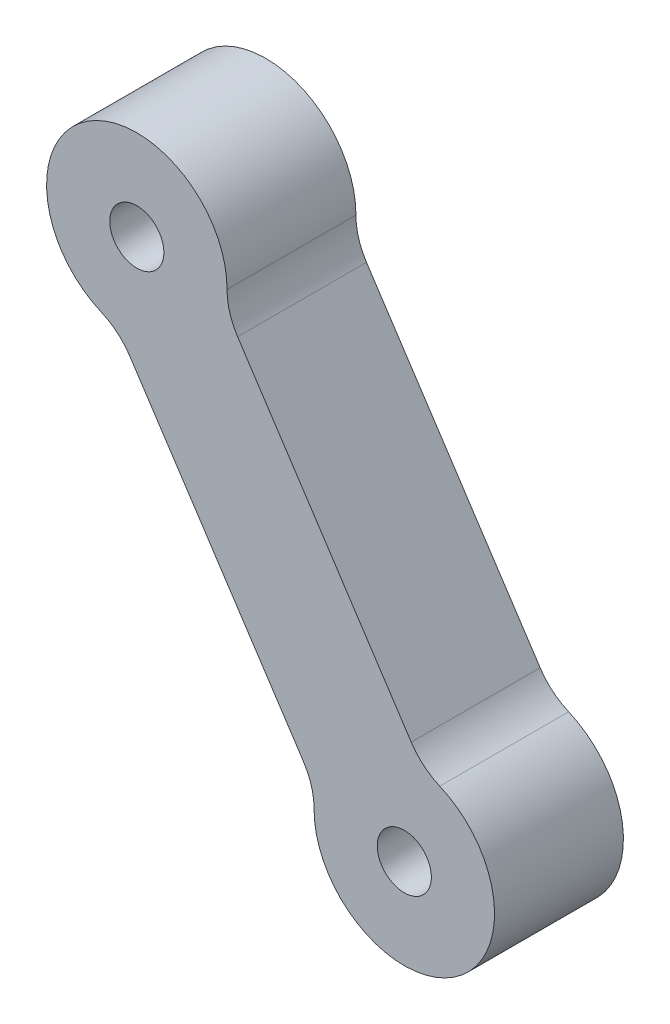
ISO-10303-21;
HEADER;
FILE_DESCRIPTION(('STEP AP214'),'2;1');
FILE_NAME('part.step','',(''),(''),'','','');
FILE_SCHEMA(('AUTOMOTIVE_DESIGN { 1 0 10303 214 1 1 1 1 }'));
ENDSEC;
DATA;
#1=APPLICATION_CONTEXT('core data for automotive mechanical design processes');
#2=APPLICATION_PROTOCOL_DEFINITION('international standard','automotive_design',2000,#1);
#3=PRODUCT_CONTEXT('',#1,'mechanical');
#4=PRODUCT('Part','Part','',(#3));
#5=PRODUCT_RELATED_PRODUCT_CATEGORY('part','',(#4));
#6=PRODUCT_DEFINITION_FORMATION('','',#4);
#7=PRODUCT_DEFINITION_CONTEXT('part definition',#1,'design');
#8=PRODUCT_DEFINITION('design','',#6,#7);
#9=PRODUCT_DEFINITION_SHAPE('','',#8);
#10=(LENGTH_UNIT() NAMED_UNIT(*) SI_UNIT(.MILLI.,.METRE.));
#11=(NAMED_UNIT(*) PLANE_ANGLE_UNIT() SI_UNIT($,.RADIAN.));
#12=(NAMED_UNIT(*) SI_UNIT($,.STERADIAN.) SOLID_ANGLE_UNIT());
#13=UNCERTAINTY_MEASURE_WITH_UNIT(LENGTH_MEASURE(1.E-05),#10,'distance_accuracy_value','');
#14=(GEOMETRIC_REPRESENTATION_CONTEXT(3) GLOBAL_UNCERTAINTY_ASSIGNED_CONTEXT((#13)) GLOBAL_UNIT_ASSIGNED_CONTEXT((#10,
#11,#12)) REPRESENTATION_CONTEXT('',''));
#15=CARTESIAN_POINT('',(0.,0.,0.));
#16=DIRECTION('',(0.,0.,1.));
#17=DIRECTION('',(1.,0.,0.));
#18=AXIS2_PLACEMENT_3D('',#15,#16,#17);
#19=CARTESIAN_POINT('',(-19.7540999404094,64.5773732818627,10.));
#20=DIRECTION('',(0.,0.,1.));
#21=DIRECTION('',(1.,0.,0.));
#22=AXIS2_PLACEMENT_3D('',#19,#20,#21);
#23=PLANE('',#22);
#24=CARTESIAN_POINT('',(-31.7539813915032,64.6309146550479,10.));
#25=DIRECTION('',(0.,0.,1.));
#26=DIRECTION('',(1.,0.,0.));
#27=AXIS2_PLACEMENT_3D('',#24,#25,#26);
#28=CIRCLE('',#27,2.1);
#29=CARTESIAN_POINT('',(-29.6539813915032,64.6309146550479,10.));
#30=VERTEX_POINT('',#29);
#31=EDGE_CURVE('E138',#30,#30,#28,.T.);
#32=ORIENTED_EDGE('',*,*,#31,.F.);
#33=EDGE_LOOP('',(#32));
#34=FACE_BOUND('',#33,.T.);
#35=CARTESIAN_POINT('',(-19.7540999404094,64.5773732818627,10.));
#36=DIRECTION('',(0.,0.,-1.));
#37=DIRECTION('',(1.,0.,0.));
#38=AXIS2_PLACEMENT_3D('',#35,#36,#37);
#39=CIRCLE('',#38,5.00000089662269);
#40=CARTESIAN_POINT('',(-23.9330576547524,61.8321371557778,10.));
#41=VERTEX_POINT('',#40);
#42=CARTESIAN_POINT('',(-24.7540510680565,64.5996821896899,10.));
#43=VERTEX_POINT('',#42);
#44=EDGE_CURVE('E149',#41,#43,#39,.T.);
#45=ORIENTED_EDGE('',*,*,#44,.T.);
#46=CARTESIAN_POINT('',(-31.7539813915032,64.6309146550479,10.));
#47=DIRECTION('',(0.,0.,1.));
#48=DIRECTION('',(1.,0.,0.));
#49=AXIS2_PLACEMENT_3D('',#46,#47,#48);
#50=CIRCLE('',#49,7.00000000000004);
#51=CARTESIAN_POINT('',(-34.5049506536515,58.1941322198,10.));
#52=VERTEX_POINT('',#51);
#53=EDGE_CURVE('E97',#43,#52,#50,.T.);
#54=ORIENTED_EDGE('',*,*,#53,.T.);
#55=CARTESIAN_POINT('',(-36.4699286980433,53.5964304803371,10.));
#56=DIRECTION('',(0.,0.,-1.));
#57=DIRECTION('',(-1.,0.,0.));
#58=AXIS2_PLACEMENT_3D('',#55,#56,#57);
#59=CIRCLE('',#58,5.00000000000024);
#60=CARTESIAN_POINT('',(-32.2909717330897,56.341666114134,10.));
#61=VERTEX_POINT('',#60);
#62=EDGE_CURVE('E164',#52,#61,#59,.T.);
#63=ORIENTED_EDGE('',*,*,#62,.T.);
#64=DIRECTION('',(0.549047126759343,-0.835791392990685,0.));
#65=VECTOR('',#64,1.);
#66=CARTESIAN_POINT('',(-32.2909717330897,56.341666114134,10.));
#67=LINE('',#66,#65);
#68=CARTESIAN_POINT('',(-18.8209235883203,35.8367772733204,10.));
#69=VERTEX_POINT('',#68);
#70=EDGE_CURVE('E177',#61,#69,#67,.T.);
#71=ORIENTED_EDGE('',*,*,#70,.T.);
#72=CARTESIAN_POINT('',(-22.9998805532737,33.0915416395237,10.));
#73=DIRECTION('',(0.,0.,-1.));
#74=DIRECTION('',(-1.,0.,0.));
#75=AXIS2_PLACEMENT_3D('',#72,#73,#74);
#76=CIRCLE('',#75,4.99999999999998);
#77=CARTESIAN_POINT('',(-17.999930322743,33.0692326230555,10.));
#78=VERTEX_POINT('',#77);
#79=EDGE_CURVE('E116',#69,#78,#76,.T.);
#80=ORIENTED_EDGE('',*,*,#79,.T.);
#81=CARTESIAN_POINT('',(-11.,33.038,10.));
#82=DIRECTION('',(0.,0.,1.));
#83=DIRECTION('',(-1.,0.,0.));
#84=AXIS2_PLACEMENT_3D('',#81,#82,#83);
#85=CIRCLE('',#84,7.);
#86=CARTESIAN_POINT('',(-8.24903053277566,39.4747823476019,10.));
#87=VERTEX_POINT('',#86);
#88=EDGE_CURVE('E110',#78,#87,#85,.T.);
#89=ORIENTED_EDGE('',*,*,#88,.T.);
#90=CARTESIAN_POINT('',(-6.28405269346,44.0724841747107,10.));
#91=DIRECTION('',(0.,0.,-1.));
#92=DIRECTION('',(1.,0.,0.));
#93=AXIS2_PLACEMENT_3D('',#90,#91,#92);
#94=CIRCLE('',#93,5.00000000000009);
#95=CARTESIAN_POINT('',(-10.4630096584135,41.3272485409139,10.));
#96=VERTEX_POINT('',#95);
#97=EDGE_CURVE('E114',#87,#96,#94,.T.);
#98=ORIENTED_EDGE('',*,*,#97,.T.);
#99=DIRECTION('',(-0.549047126759344,0.835791392990684,0.));
#100=VECTOR('',#99,1.);
#101=CARTESIAN_POINT('',(-23.9330576547524,61.8321371557778,10.));
#102=LINE('',#101,#100);
#103=EDGE_CURVE('E54',#96,#41,#102,.T.);
#104=ORIENTED_EDGE('',*,*,#103,.T.);
#105=EDGE_LOOP('',(#45,#54,#63,#71,#80,#89,#98,#104));
#106=FACE_BOUND('',#105,.T.);
#107=CARTESIAN_POINT('',(-11.,33.038,10.));
#108=DIRECTION('',(0.,0.,1.));
#109=DIRECTION('',(1.,0.,0.));
#110=AXIS2_PLACEMENT_3D('',#107,#108,#109);
#111=CIRCLE('',#110,2.1);
#112=CARTESIAN_POINT('',(-8.9,33.038,10.));
#113=VERTEX_POINT('',#112);
#114=EDGE_CURVE('E186',#113,#113,#111,.T.);
#115=ORIENTED_EDGE('',*,*,#114,.F.);
#116=EDGE_LOOP('',(#115));
#117=FACE_BOUND('',#116,.T.);
#118=ADVANCED_FACE('F37',(#34,#106,#117),#23,.T.);
#119=CARTESIAN_POINT('',(-19.7540999404094,64.5773732818627,0.));
#120=DIRECTION('',(0.,0.,1.));
#121=DIRECTION('',(1.,0.,0.));
#122=AXIS2_PLACEMENT_3D('',#119,#120,#121);
#123=PLANE('',#122);
#124=CARTESIAN_POINT('',(-19.7540999404094,64.5773732818627,0.));
#125=DIRECTION('',(0.,0.,-1.));
#126=DIRECTION('',(1.,0.,0.));
#127=AXIS2_PLACEMENT_3D('',#124,#125,#126);
#128=CIRCLE('',#127,5.00000089662269);
#129=CARTESIAN_POINT('',(-23.9330576547524,61.8321371557778,0.));
#130=VERTEX_POINT('',#129);
#131=CARTESIAN_POINT('',(-24.7540510680565,64.5996821896899,0.));
#132=VERTEX_POINT('',#131);
#133=EDGE_CURVE('E134',#130,#132,#128,.T.);
#134=ORIENTED_EDGE('',*,*,#133,.F.);
#135=DIRECTION('',(-0.549047126759344,0.835791392990684,0.));
#136=VECTOR('',#135,1.);
#137=CARTESIAN_POINT('',(-23.9330576547524,61.8321371557778,0.));
#138=LINE('',#137,#136);
#139=CARTESIAN_POINT('',(-10.4630096584135,41.3272485409139,0.));
#140=VERTEX_POINT('',#139);
#141=EDGE_CURVE('E89',#140,#130,#138,.T.);
#142=ORIENTED_EDGE('',*,*,#141,.F.);
#143=CARTESIAN_POINT('',(-6.28405269346,44.0724841747107,0.));
#144=DIRECTION('',(0.,0.,-1.));
#145=DIRECTION('',(1.,0.,0.));
#146=AXIS2_PLACEMENT_3D('',#143,#144,#145);
#147=CIRCLE('',#146,5.00000000000009);
#148=CARTESIAN_POINT('',(-8.24903053277566,39.4747823476019,0.));
#149=VERTEX_POINT('',#148);
#150=EDGE_CURVE('E83',#149,#140,#147,.T.);
#151=ORIENTED_EDGE('',*,*,#150,.F.);
#152=CARTESIAN_POINT('',(-11.,33.038,0.));
#153=DIRECTION('',(0.,0.,1.));
#154=DIRECTION('',(-1.,0.,0.));
#155=AXIS2_PLACEMENT_3D('',#152,#153,#154);
#156=CIRCLE('',#155,7.);
#157=CARTESIAN_POINT('',(-17.999930322743,33.0692326230555,0.));
#158=VERTEX_POINT('',#157);
#159=EDGE_CURVE('E124',#158,#149,#156,.T.);
#160=ORIENTED_EDGE('',*,*,#159,.F.);
#161=CARTESIAN_POINT('',(-22.9998805532737,33.0915416395237,0.));
#162=DIRECTION('',(0.,0.,-1.));
#163=DIRECTION('',(-1.,0.,0.));
#164=AXIS2_PLACEMENT_3D('',#161,#162,#163);
#165=CIRCLE('',#164,4.99999999999998);
#166=CARTESIAN_POINT('',(-18.8209235883203,35.8367772733204,0.));
#167=VERTEX_POINT('',#166);
#168=EDGE_CURVE('E144',#167,#158,#165,.T.);
#169=ORIENTED_EDGE('',*,*,#168,.F.);
#170=DIRECTION('',(0.549047126759343,-0.835791392990685,0.));
#171=VECTOR('',#170,1.);
#172=CARTESIAN_POINT('',(-32.2909717330897,56.341666114134,0.));
#173=LINE('',#172,#171);
#174=CARTESIAN_POINT('',(-32.2909717330897,56.341666114134,0.));
#175=VERTEX_POINT('',#174);
#176=EDGE_CURVE('E142',#175,#167,#173,.T.);
#177=ORIENTED_EDGE('',*,*,#176,.F.);
#178=CARTESIAN_POINT('',(-36.4699286980433,53.5964304803371,0.));
#179=DIRECTION('',(0.,0.,-1.));
#180=DIRECTION('',(-1.,0.,0.));
#181=AXIS2_PLACEMENT_3D('',#178,#179,#180);
#182=CIRCLE('',#181,5.00000000000024);
#183=CARTESIAN_POINT('',(-34.5049506536515,58.1941322198,0.));
#184=VERTEX_POINT('',#183);
#185=EDGE_CURVE('E140',#184,#175,#182,.T.);
#186=ORIENTED_EDGE('',*,*,#185,.F.);
#187=CARTESIAN_POINT('',(-31.7539813915032,64.6309146550479,0.));
#188=DIRECTION('',(0.,0.,1.));
#189=DIRECTION('',(1.,0.,0.));
#190=AXIS2_PLACEMENT_3D('',#187,#188,#189);
#191=CIRCLE('',#190,7.00000000000004);
#192=EDGE_CURVE('E137',#132,#184,#191,.T.);
#193=ORIENTED_EDGE('',*,*,#192,.F.);
#194=EDGE_LOOP('',(#134,#142,#151,#160,#169,#177,#186,#193));
#195=FACE_BOUND('',#194,.T.);
#196=CARTESIAN_POINT('',(-31.7539813915032,64.6309146550479,0.));
#197=DIRECTION('',(0.,0.,1.));
#198=DIRECTION('',(1.,0.,0.));
#199=AXIS2_PLACEMENT_3D('',#196,#197,#198);
#200=CIRCLE('',#199,2.1);
#201=CARTESIAN_POINT('',(-29.6539813915032,64.6309146550479,0.));
#202=VERTEX_POINT('',#201);
#203=EDGE_CURVE('E183',#202,#202,#200,.T.);
#204=ORIENTED_EDGE('',*,*,#203,.T.);
#205=EDGE_LOOP('',(#204));
#206=FACE_BOUND('',#205,.T.);
#207=CARTESIAN_POINT('',(-11.,33.038,0.));
#208=DIRECTION('',(0.,0.,1.));
#209=DIRECTION('',(1.,0.,0.));
#210=AXIS2_PLACEMENT_3D('',#207,#208,#209);
#211=CIRCLE('',#210,2.1);
#212=CARTESIAN_POINT('',(-8.9,33.038,0.));
#213=VERTEX_POINT('',#212);
#214=EDGE_CURVE('E189',#213,#213,#211,.T.);
#215=ORIENTED_EDGE('',*,*,#214,.T.);
#216=EDGE_LOOP('',(#215));
#217=FACE_BOUND('',#216,.T.);
#218=ADVANCED_FACE('F168',(#195,#206,#217),#123,.F.);
#219=CARTESIAN_POINT('',(-19.7540999404094,64.5773732818627,10.));
#220=DIRECTION('',(0.,0.,-1.));
#221=DIRECTION('',(-1.,0.,0.));
#222=AXIS2_PLACEMENT_3D('',#219,#220,#221);
#223=CYLINDRICAL_SURFACE('',#222,5.00000089662269);
#224=ORIENTED_EDGE('',*,*,#133,.T.);
#225=DIRECTION('',(0.,0.,-1.));
#226=VECTOR('',#225,1.);
#227=CARTESIAN_POINT('',(-24.7540510680565,64.5996821896899,10.));
#228=LINE('',#227,#226);
#229=EDGE_CURVE('E11',#43,#132,#228,.T.);
#230=ORIENTED_EDGE('',*,*,#229,.F.);
#231=ORIENTED_EDGE('',*,*,#44,.F.);
#232=DIRECTION('',(0.,0.,-1.));
#233=VECTOR('',#232,1.);
#234=CARTESIAN_POINT('',(-23.9330576547524,61.8321371557778,10.));
#235=LINE('',#234,#233);
#236=EDGE_CURVE('E130',#41,#130,#235,.T.);
#237=ORIENTED_EDGE('',*,*,#236,.T.);
#238=EDGE_LOOP('',(#224,#230,#231,#237));
#239=FACE_BOUND('',#238,.T.);
#240=ADVANCED_FACE('F39',(#239),#223,.F.);
#241=CARTESIAN_POINT('',(-31.7539813915032,64.6309146550479,10.));
#242=DIRECTION('',(0.,0.,-1.));
#243=DIRECTION('',(-1.,0.,0.));
#244=AXIS2_PLACEMENT_3D('',#241,#242,#243);
#245=CYLINDRICAL_SURFACE('',#244,7.00000000000004);
#246=ORIENTED_EDGE('',*,*,#192,.T.);
#247=DIRECTION('',(0.,0.,-1.));
#248=VECTOR('',#247,1.);
#249=CARTESIAN_POINT('',(-34.5049506536515,58.1941322198,10.));
#250=LINE('',#249,#248);
#251=EDGE_CURVE('E46',#52,#184,#250,.T.);
#252=ORIENTED_EDGE('',*,*,#251,.F.);
#253=ORIENTED_EDGE('',*,*,#53,.F.);
#254=ORIENTED_EDGE('',*,*,#229,.T.);
#255=EDGE_LOOP('',(#246,#252,#253,#254));
#256=FACE_BOUND('',#255,.T.);
#257=ADVANCED_FACE('F221',(#256),#245,.T.);
#258=CARTESIAN_POINT('',(-36.4699286980433,53.5964304803371,10.));
#259=DIRECTION('',(0.,0.,-1.));
#260=DIRECTION('',(-1.,0.,0.));
#261=AXIS2_PLACEMENT_3D('',#258,#259,#260);
#262=CYLINDRICAL_SURFACE('',#261,5.00000000000024);
#263=ORIENTED_EDGE('',*,*,#185,.T.);
#264=DIRECTION('',(0.,0.,-1.));
#265=VECTOR('',#264,1.);
#266=CARTESIAN_POINT('',(-32.2909717330897,56.341666114134,10.));
#267=LINE('',#266,#265);
#268=EDGE_CURVE('E156',#61,#175,#267,.T.);
#269=ORIENTED_EDGE('',*,*,#268,.F.);
#270=ORIENTED_EDGE('',*,*,#62,.F.);
#271=ORIENTED_EDGE('',*,*,#251,.T.);
#272=EDGE_LOOP('',(#263,#269,#270,#271));
#273=FACE_BOUND('',#272,.T.);
#274=ADVANCED_FACE('F162',(#273),#262,.F.);
#275=CARTESIAN_POINT('',(-32.2909717330897,56.341666114134,10.));
#276=DIRECTION('',(0.835791392990685,0.549047126759343,0.));
#277=DIRECTION('',(-0.549047126759343,0.835791392990685,0.));
#278=AXIS2_PLACEMENT_3D('',#275,#276,#277);
#279=PLANE('',#278);
#280=ORIENTED_EDGE('',*,*,#176,.T.);
#281=DIRECTION('',(0.,0.,-1.));
#282=VECTOR('',#281,1.);
#283=CARTESIAN_POINT('',(-18.8209235883203,35.8367772733204,10.));
#284=LINE('',#283,#282);
#285=EDGE_CURVE('E153',#69,#167,#284,.T.);
#286=ORIENTED_EDGE('',*,*,#285,.F.);
#287=ORIENTED_EDGE('',*,*,#70,.F.);
#288=ORIENTED_EDGE('',*,*,#268,.T.);
#289=EDGE_LOOP('',(#280,#286,#287,#288));
#290=FACE_BOUND('',#289,.T.);
#291=ADVANCED_FACE('F173',(#290),#279,.F.);
#292=CARTESIAN_POINT('',(-22.9998805532737,33.0915416395237,10.));
#293=DIRECTION('',(0.,0.,-1.));
#294=DIRECTION('',(-1.,0.,0.));
#295=AXIS2_PLACEMENT_3D('',#292,#293,#294);
#296=CYLINDRICAL_SURFACE('',#295,4.99999999999998);
#297=ORIENTED_EDGE('',*,*,#168,.T.);
#298=DIRECTION('',(0.,0.,-1.));
#299=VECTOR('',#298,1.);
#300=CARTESIAN_POINT('',(-17.999930322743,33.0692326230555,10.));
#301=LINE('',#300,#299);
#302=EDGE_CURVE('E125',#78,#158,#301,.T.);
#303=ORIENTED_EDGE('',*,*,#302,.F.);
#304=ORIENTED_EDGE('',*,*,#79,.F.);
#305=ORIENTED_EDGE('',*,*,#285,.T.);
#306=EDGE_LOOP('',(#297,#303,#304,#305));
#307=FACE_BOUND('',#306,.T.);
#308=ADVANCED_FACE('F176',(#307),#296,.F.);
#309=CARTESIAN_POINT('',(-11.,33.038,10.));
#310=DIRECTION('',(0.,0.,-1.));
#311=DIRECTION('',(-1.,0.,0.));
#312=AXIS2_PLACEMENT_3D('',#309,#310,#311);
#313=CYLINDRICAL_SURFACE('',#312,7.);
#314=ORIENTED_EDGE('',*,*,#159,.T.);
#315=DIRECTION('',(0.,0.,-1.));
#316=VECTOR('',#315,1.);
#317=CARTESIAN_POINT('',(-8.24903053277566,39.4747823476019,10.));
#318=LINE('',#317,#316);
#319=EDGE_CURVE('E121',#87,#149,#318,.T.);
#320=ORIENTED_EDGE('',*,*,#319,.F.);
#321=ORIENTED_EDGE('',*,*,#88,.F.);
#322=ORIENTED_EDGE('',*,*,#302,.T.);
#323=EDGE_LOOP('',(#314,#320,#321,#322));
#324=FACE_BOUND('',#323,.T.);
#325=ADVANCED_FACE('F122',(#324),#313,.T.);
#326=CARTESIAN_POINT('',(-6.28405269346,44.0724841747107,10.));
#327=DIRECTION('',(0.,0.,-1.));
#328=DIRECTION('',(-1.,0.,0.));
#329=AXIS2_PLACEMENT_3D('',#326,#327,#328);
#330=CYLINDRICAL_SURFACE('',#329,5.00000000000009);
#331=ORIENTED_EDGE('',*,*,#150,.T.);
#332=DIRECTION('',(0.,0.,-1.));
#333=VECTOR('',#332,1.);
#334=CARTESIAN_POINT('',(-10.4630096584135,41.3272485409139,10.));
#335=LINE('',#334,#333);
#336=EDGE_CURVE('E126',#96,#140,#335,.T.);
#337=ORIENTED_EDGE('',*,*,#336,.F.);
#338=ORIENTED_EDGE('',*,*,#97,.F.);
#339=ORIENTED_EDGE('',*,*,#319,.T.);
#340=EDGE_LOOP('',(#331,#337,#338,#339));
#341=FACE_BOUND('',#340,.T.);
#342=ADVANCED_FACE('F128',(#341),#330,.F.);
#343=CARTESIAN_POINT('',(-23.9330576547524,61.8321371557778,10.));
#344=DIRECTION('',(-0.835791392990684,-0.549047126759344,0.));
#345=DIRECTION('',(0.549047126759344,-0.835791392990684,0.));
#346=AXIS2_PLACEMENT_3D('',#343,#344,#345);
#347=PLANE('',#346);
#348=ORIENTED_EDGE('',*,*,#141,.T.);
#349=ORIENTED_EDGE('',*,*,#236,.F.);
#350=ORIENTED_EDGE('',*,*,#103,.F.);
#351=ORIENTED_EDGE('',*,*,#336,.T.);
#352=EDGE_LOOP('',(#348,#349,#350,#351));
#353=FACE_BOUND('',#352,.T.);
#354=ADVANCED_FACE('F209',(#353),#347,.F.);
#355=CARTESIAN_POINT('',(-31.7539813915032,64.6309146550479,10.));
#356=DIRECTION('',(0.,0.,-1.));
#357=DIRECTION('',(-1.,0.,0.));
#358=AXIS2_PLACEMENT_3D('',#355,#356,#357);
#359=CYLINDRICAL_SURFACE('',#358,2.1);
#360=ORIENTED_EDGE('',*,*,#31,.T.);
#361=EDGE_LOOP('',(#360));
#362=FACE_BOUND('',#361,.T.);
#363=ORIENTED_EDGE('',*,*,#203,.F.);
#364=EDGE_LOOP('',(#363));
#365=FACE_BOUND('',#364,.T.);
#366=ADVANCED_FACE('F206',(#362,#365),#359,.F.);
#367=CARTESIAN_POINT('',(-11.,33.038,10.));
#368=DIRECTION('',(0.,0.,-1.));
#369=DIRECTION('',(-1.,0.,0.));
#370=AXIS2_PLACEMENT_3D('',#367,#368,#369);
#371=CYLINDRICAL_SURFACE('',#370,2.1);
#372=ORIENTED_EDGE('',*,*,#114,.T.);
#373=EDGE_LOOP('',(#372));
#374=FACE_BOUND('',#373,.T.);
#375=ORIENTED_EDGE('',*,*,#214,.F.);
#376=EDGE_LOOP('',(#375));
#377=FACE_BOUND('',#376,.T.);
#378=ADVANCED_FACE('F195',(#374,#377),#371,.F.);
#379=CLOSED_SHELL('',(#118,#218,#240,#257,#274,#291,#308,#325,#342,#354,#366,#378));
#380=MANIFOLD_SOLID_BREP('B2',#379);
#381=ADVANCED_BREP_SHAPE_REPRESENTATION('',(#18,#380),#14);
#382=SHAPE_DEFINITION_REPRESENTATION(#9,#381);
ENDSEC;
END-ISO-10303-21;
